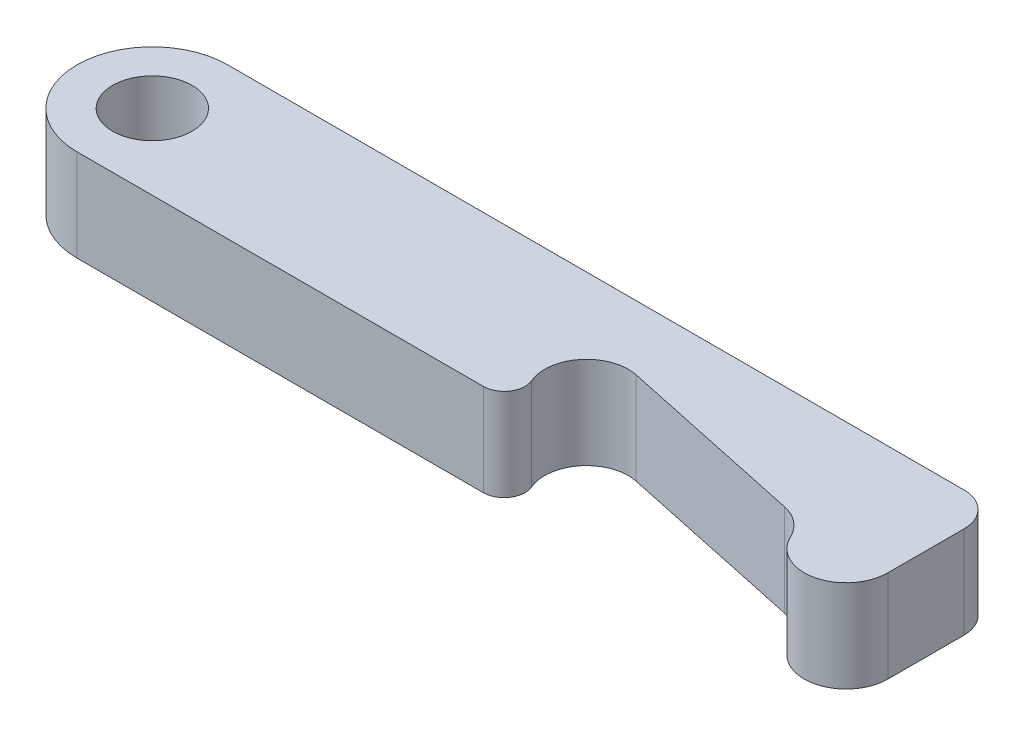
ISO-10303-21;
HEADER;
FILE_DESCRIPTION(('STEP AP214'),'2;1');
FILE_NAME('part.step','',(''),(''),'','','');
FILE_SCHEMA(('AUTOMOTIVE_DESIGN { 1 0 10303 214 1 1 1 1 }'));
ENDSEC;
DATA;
#1=APPLICATION_CONTEXT('core data for automotive mechanical design processes');
#2=APPLICATION_PROTOCOL_DEFINITION('international standard','automotive_design',2000,#1);
#3=PRODUCT_CONTEXT('',#1,'mechanical');
#4=PRODUCT('Part','Part','',(#3));
#5=PRODUCT_RELATED_PRODUCT_CATEGORY('part','',(#4));
#6=PRODUCT_DEFINITION_FORMATION('','',#4);
#7=PRODUCT_DEFINITION_CONTEXT('part definition',#1,'design');
#8=PRODUCT_DEFINITION('design','',#6,#7);
#9=PRODUCT_DEFINITION_SHAPE('','',#8);
#10=(LENGTH_UNIT() NAMED_UNIT(*) SI_UNIT(.MILLI.,.METRE.));
#11=(NAMED_UNIT(*) PLANE_ANGLE_UNIT() SI_UNIT($,.RADIAN.));
#12=(NAMED_UNIT(*) SI_UNIT($,.STERADIAN.) SOLID_ANGLE_UNIT());
#13=UNCERTAINTY_MEASURE_WITH_UNIT(LENGTH_MEASURE(1.E-05),#10,'distance_accuracy_value','');
#14=(GEOMETRIC_REPRESENTATION_CONTEXT(3) GLOBAL_UNCERTAINTY_ASSIGNED_CONTEXT((#13)) GLOBAL_UNIT_ASSIGNED_CONTEXT((#10,
#11,#12)) REPRESENTATION_CONTEXT('',''));
#15=CARTESIAN_POINT('',(0.,0.,0.));
#16=DIRECTION('',(0.,0.,1.));
#17=DIRECTION('',(1.,0.,0.));
#18=AXIS2_PLACEMENT_3D('',#15,#16,#17);
#19=CARTESIAN_POINT('',(0.,11.,0.));
#20=DIRECTION('',(0.,-1.,0.));
#21=DIRECTION('',(0.,0.,-1.));
#22=AXIS2_PLACEMENT_3D('',#19,#20,#21);
#23=PLANE('',#22);
#24=CARTESIAN_POINT('',(0.,11.,0.));
#25=DIRECTION('',(0.,1.,0.));
#26=DIRECTION('',(0.,0.,-1.));
#27=AXIS2_PLACEMENT_3D('',#24,#25,#26);
#28=CIRCLE('',#27,9.);
#29=CARTESIAN_POINT('',(0.,11.,-9.));
#30=VERTEX_POINT('',#29);
#31=CARTESIAN_POINT('',(0.,11.,9.));
#32=VERTEX_POINT('',#31);
#33=EDGE_CURVE('E186',#30,#32,#28,.T.);
#34=ORIENTED_EDGE('',*,*,#33,.T.);
#35=DIRECTION('',(1.,0.,0.));
#36=VECTOR('',#35,1.);
#37=CARTESIAN_POINT('',(0.,11.,9.));
#38=LINE('',#37,#36);
#39=CARTESIAN_POINT('',(48.5363182695525,11.,9.));
#40=VERTEX_POINT('',#39);
#41=EDGE_CURVE('E110',#32,#40,#38,.T.);
#42=ORIENTED_EDGE('',*,*,#41,.T.);
#43=CARTESIAN_POINT('',(48.5363182695525,11.,6.5));
#44=DIRECTION('',(0.,1.,0.));
#45=DIRECTION('',(0.,0.,-1.));
#46=AXIS2_PLACEMENT_3D('',#43,#44,#45);
#47=CIRCLE('',#46,2.5);
#48=CARTESIAN_POINT('',(50.8371468394263,11.,5.52215139614962));
#49=VERTEX_POINT('',#48);
#50=EDGE_CURVE('E215',#40,#49,#47,.T.);
#51=ORIENTED_EDGE('',*,*,#50,.T.);
#52=CARTESIAN_POINT('',(55.4388039791741,11.,3.56645418844886));
#53=DIRECTION('',(0.,-1.,0.));
#54=DIRECTION('',(0.,0.,1.));
#55=AXIS2_PLACEMENT_3D('',#52,#53,#54);
#56=CIRCLE('',#55,5.);
#57=CARTESIAN_POINT('',(56.4783624332629,11.,-1.32428381522018));
#58=VERTEX_POINT('',#57);
#59=EDGE_CURVE('E235',#49,#58,#56,.T.);
#60=ORIENTED_EDGE('',*,*,#59,.T.);
#61=DIRECTION('',(0.978147600733807,0.,0.207911690817753));
#62=VECTOR('',#61,1.);
#63=CARTESIAN_POINT('',(78.9783624332629,11.,3.45823882235517));
#64=LINE('',#63,#62);
#65=CARTESIAN_POINT('',(78.9783624332629,11.,3.45823882235517));
#66=VERTEX_POINT('',#65);
#67=EDGE_CURVE('E231',#58,#66,#64,.T.);
#68=ORIENTED_EDGE('',*,*,#67,.T.);
#69=CARTESIAN_POINT('',(77.9388039791741,11.,8.3489768260242));
#70=DIRECTION('',(0.,-1.,0.));
#71=DIRECTION('',(0.,0.,1.));
#72=AXIS2_PLACEMENT_3D('',#69,#70,#71);
#73=CIRCLE('',#72,5.);
#74=CARTESIAN_POINT('',(82.4694019895871,11.,6.23386886943139));
#75=VERTEX_POINT('',#74);
#76=EDGE_CURVE('E234',#66,#75,#73,.T.);
#77=ORIENTED_EDGE('',*,*,#76,.T.);
#78=CARTESIAN_POINT('',(87.,11.,4.11876091283859));
#79=DIRECTION('',(0.,1.,0.));
#80=DIRECTION('',(0.,0.,-1.));
#81=AXIS2_PLACEMENT_3D('',#78,#79,#80);
#82=CIRCLE('',#81,5.00000000000001);
#83=CARTESIAN_POINT('',(92.,11.,4.11876091283859));
#84=VERTEX_POINT('',#83);
#85=EDGE_CURVE('E135',#75,#84,#82,.T.);
#86=ORIENTED_EDGE('',*,*,#85,.T.);
#87=DIRECTION('',(0.,0.,-1.));
#88=VECTOR('',#87,1.);
#89=CARTESIAN_POINT('',(92.,11.,-5.));
#90=LINE('',#89,#88);
#91=CARTESIAN_POINT('',(92.,11.,-5.));
#92=VERTEX_POINT('',#91);
#93=EDGE_CURVE('E129',#84,#92,#90,.T.);
#94=ORIENTED_EDGE('',*,*,#93,.T.);
#95=CARTESIAN_POINT('',(88.,11.,-5.));
#96=DIRECTION('',(0.,1.,0.));
#97=DIRECTION('',(0.,0.,-1.));
#98=AXIS2_PLACEMENT_3D('',#95,#96,#97);
#99=CIRCLE('',#98,4.);
#100=CARTESIAN_POINT('',(88.,11.,-9.));
#101=VERTEX_POINT('',#100);
#102=EDGE_CURVE('E133',#92,#101,#99,.T.);
#103=ORIENTED_EDGE('',*,*,#102,.T.);
#104=DIRECTION('',(-1.,0.,0.));
#105=VECTOR('',#104,1.);
#106=CARTESIAN_POINT('',(0.,11.,-9.));
#107=LINE('',#106,#105);
#108=EDGE_CURVE('E61',#101,#30,#107,.T.);
#109=ORIENTED_EDGE('',*,*,#108,.T.);
#110=EDGE_LOOP('',(#34,#42,#51,#60,#68,#77,#86,#94,#103,#109));
#111=FACE_BOUND('',#110,.T.);
#112=CARTESIAN_POINT('',(0.,11.,0.));
#113=DIRECTION('',(0.,1.,0.));
#114=DIRECTION('',(0.,0.,1.));
#115=AXIS2_PLACEMENT_3D('',#112,#113,#114);
#116=CIRCLE('',#115,4.75);
#117=CARTESIAN_POINT('',(0.,11.,4.75));
#118=VERTEX_POINT('',#117);
#119=EDGE_CURVE('E162',#118,#118,#116,.T.);
#120=ORIENTED_EDGE('',*,*,#119,.F.);
#121=EDGE_LOOP('',(#120));
#122=FACE_BOUND('',#121,.T.);
#123=ADVANCED_FACE('F43',(#111,#122),#23,.F.);
#124=CARTESIAN_POINT('',(0.,0.,0.));
#125=DIRECTION('',(0.,-1.,0.));
#126=DIRECTION('',(0.,0.,-1.));
#127=AXIS2_PLACEMENT_3D('',#124,#125,#126);
#128=PLANE('',#127);
#129=CARTESIAN_POINT('',(0.,0.,0.));
#130=DIRECTION('',(0.,1.,0.));
#131=DIRECTION('',(0.,0.,-1.));
#132=AXIS2_PLACEMENT_3D('',#129,#130,#131);
#133=CIRCLE('',#132,9.);
#134=CARTESIAN_POINT('',(0.,0.,-9.));
#135=VERTEX_POINT('',#134);
#136=CARTESIAN_POINT('',(0.,0.,9.));
#137=VERTEX_POINT('',#136);
#138=EDGE_CURVE('E157',#135,#137,#133,.T.);
#139=ORIENTED_EDGE('',*,*,#138,.F.);
#140=DIRECTION('',(-1.,0.,0.));
#141=VECTOR('',#140,1.);
#142=CARTESIAN_POINT('',(0.,0.,-9.));
#143=LINE('',#142,#141);
#144=CARTESIAN_POINT('',(88.,0.,-9.));
#145=VERTEX_POINT('',#144);
#146=EDGE_CURVE('E102',#145,#135,#143,.T.);
#147=ORIENTED_EDGE('',*,*,#146,.F.);
#148=CARTESIAN_POINT('',(88.,0.,-5.));
#149=DIRECTION('',(0.,1.,0.));
#150=DIRECTION('',(0.,0.,-1.));
#151=AXIS2_PLACEMENT_3D('',#148,#149,#150);
#152=CIRCLE('',#151,4.);
#153=CARTESIAN_POINT('',(92.,0.,-5.));
#154=VERTEX_POINT('',#153);
#155=EDGE_CURVE('E96',#154,#145,#152,.T.);
#156=ORIENTED_EDGE('',*,*,#155,.F.);
#157=DIRECTION('',(0.,0.,-1.));
#158=VECTOR('',#157,1.);
#159=CARTESIAN_POINT('',(92.,0.,-5.));
#160=LINE('',#159,#158);
#161=CARTESIAN_POINT('',(92.,0.,4.11876091283859));
#162=VERTEX_POINT('',#161);
#163=EDGE_CURVE('E144',#162,#154,#160,.T.);
#164=ORIENTED_EDGE('',*,*,#163,.F.);
#165=CARTESIAN_POINT('',(87.,0.,4.11876091283859));
#166=DIRECTION('',(0.,1.,0.));
#167=DIRECTION('',(0.,0.,-1.));
#168=AXIS2_PLACEMENT_3D('',#165,#166,#167);
#169=CIRCLE('',#168,5.00000000000001);
#170=CARTESIAN_POINT('',(82.4694019895871,0.,6.23386886943139));
#171=VERTEX_POINT('',#170);
#172=EDGE_CURVE('E177',#171,#162,#169,.T.);
#173=ORIENTED_EDGE('',*,*,#172,.F.);
#174=CARTESIAN_POINT('',(77.9388039791741,0.,8.3489768260242));
#175=DIRECTION('',(0.,-1.,0.));
#176=DIRECTION('',(0.,0.,1.));
#177=AXIS2_PLACEMENT_3D('',#174,#175,#176);
#178=CIRCLE('',#177,5.);
#179=CARTESIAN_POINT('',(78.9783624332629,0.,3.45823882235517));
#180=VERTEX_POINT('',#179);
#181=EDGE_CURVE('E174',#180,#171,#178,.T.);
#182=ORIENTED_EDGE('',*,*,#181,.F.);
#183=DIRECTION('',(0.978147600733807,0.,0.207911690817753));
#184=VECTOR('',#183,1.);
#185=CARTESIAN_POINT('',(78.9783624332629,0.,3.45823882235517));
#186=LINE('',#185,#184);
#187=CARTESIAN_POINT('',(56.4783624332629,0.,-1.32428381522018));
#188=VERTEX_POINT('',#187);
#189=EDGE_CURVE('E171',#188,#180,#186,.T.);
#190=ORIENTED_EDGE('',*,*,#189,.F.);
#191=CARTESIAN_POINT('',(55.4388039791741,0.,3.56645418844886));
#192=DIRECTION('',(0.,-1.,0.));
#193=DIRECTION('',(0.,0.,1.));
#194=AXIS2_PLACEMENT_3D('',#191,#192,#193);
#195=CIRCLE('',#194,5.);
#196=CARTESIAN_POINT('',(50.8371468394263,0.,5.52215139614962));
#197=VERTEX_POINT('',#196);
#198=EDGE_CURVE('E168',#197,#188,#195,.T.);
#199=ORIENTED_EDGE('',*,*,#198,.F.);
#200=CARTESIAN_POINT('',(48.5363182695525,0.,6.5));
#201=DIRECTION('',(0.,1.,0.));
#202=DIRECTION('',(0.,0.,-1.));
#203=AXIS2_PLACEMENT_3D('',#200,#201,#202);
#204=CIRCLE('',#203,2.5);
#205=CARTESIAN_POINT('',(48.5363182695525,0.,9.));
#206=VERTEX_POINT('',#205);
#207=EDGE_CURVE('E165',#206,#197,#204,.T.);
#208=ORIENTED_EDGE('',*,*,#207,.F.);
#209=DIRECTION('',(1.,0.,0.));
#210=VECTOR('',#209,1.);
#211=CARTESIAN_POINT('',(0.,0.,9.));
#212=LINE('',#211,#210);
#213=EDGE_CURVE('E161',#137,#206,#212,.T.);
#214=ORIENTED_EDGE('',*,*,#213,.F.);
#215=EDGE_LOOP('',(#139,#147,#156,#164,#173,#182,#190,#199,#208,#214));
#216=FACE_BOUND('',#215,.T.);
#217=CARTESIAN_POINT('',(0.,0.,0.));
#218=DIRECTION('',(0.,1.,0.));
#219=DIRECTION('',(0.,0.,1.));
#220=AXIS2_PLACEMENT_3D('',#217,#218,#219);
#221=CIRCLE('',#220,4.75);
#222=CARTESIAN_POINT('',(0.,0.,4.75));
#223=VERTEX_POINT('',#222);
#224=EDGE_CURVE('E249',#223,#223,#221,.T.);
#225=ORIENTED_EDGE('',*,*,#224,.T.);
#226=EDGE_LOOP('',(#225));
#227=FACE_BOUND('',#226,.T.);
#228=ADVANCED_FACE('F219',(#216,#227),#128,.T.);
#229=CARTESIAN_POINT('',(0.,11.,0.));
#230=DIRECTION('',(0.,-1.,0.));
#231=DIRECTION('',(0.,0.,-1.));
#232=AXIS2_PLACEMENT_3D('',#229,#230,#231);
#233=CYLINDRICAL_SURFACE('',#232,9.);
#234=ORIENTED_EDGE('',*,*,#138,.T.);
#235=DIRECTION('',(0.,-1.,0.));
#236=VECTOR('',#235,1.);
#237=CARTESIAN_POINT('',(0.,11.,9.));
#238=LINE('',#237,#236);
#239=EDGE_CURVE('E11',#32,#137,#238,.T.);
#240=ORIENTED_EDGE('',*,*,#239,.F.);
#241=ORIENTED_EDGE('',*,*,#33,.F.);
#242=DIRECTION('',(0.,-1.,0.));
#243=VECTOR('',#242,1.);
#244=CARTESIAN_POINT('',(0.,11.,-9.));
#245=LINE('',#244,#243);
#246=EDGE_CURVE('E153',#30,#135,#245,.T.);
#247=ORIENTED_EDGE('',*,*,#246,.T.);
#248=EDGE_LOOP('',(#234,#240,#241,#247));
#249=FACE_BOUND('',#248,.T.);
#250=ADVANCED_FACE('F45',(#249),#233,.T.);
#251=CARTESIAN_POINT('',(0.,11.,9.));
#252=DIRECTION('',(0.,0.,-1.));
#253=DIRECTION('',(-1.,0.,0.));
#254=AXIS2_PLACEMENT_3D('',#251,#252,#253);
#255=PLANE('',#254);
#256=ORIENTED_EDGE('',*,*,#213,.T.);
#257=DIRECTION('',(0.,-1.,0.));
#258=VECTOR('',#257,1.);
#259=CARTESIAN_POINT('',(48.5363182695525,11.,9.));
#260=LINE('',#259,#258);
#261=EDGE_CURVE('E53',#40,#206,#260,.T.);
#262=ORIENTED_EDGE('',*,*,#261,.F.);
#263=ORIENTED_EDGE('',*,*,#41,.F.);
#264=ORIENTED_EDGE('',*,*,#239,.T.);
#265=EDGE_LOOP('',(#256,#262,#263,#264));
#266=FACE_BOUND('',#265,.T.);
#267=ADVANCED_FACE('F287',(#266),#255,.F.);
#268=CARTESIAN_POINT('',(48.5363182695525,11.,6.5));
#269=DIRECTION('',(0.,-1.,0.));
#270=DIRECTION('',(0.,0.,-1.));
#271=AXIS2_PLACEMENT_3D('',#268,#269,#270);
#272=CYLINDRICAL_SURFACE('',#271,2.5);
#273=ORIENTED_EDGE('',*,*,#207,.T.);
#274=DIRECTION('',(0.,-1.,0.));
#275=VECTOR('',#274,1.);
#276=CARTESIAN_POINT('',(50.8371468394263,11.,5.52215139614962));
#277=LINE('',#276,#275);
#278=EDGE_CURVE('E205',#49,#197,#277,.T.);
#279=ORIENTED_EDGE('',*,*,#278,.F.);
#280=ORIENTED_EDGE('',*,*,#50,.F.);
#281=ORIENTED_EDGE('',*,*,#261,.T.);
#282=EDGE_LOOP('',(#273,#279,#280,#281));
#283=FACE_BOUND('',#282,.T.);
#284=ADVANCED_FACE('F213',(#283),#272,.T.);
#285=CARTESIAN_POINT('',(55.4388039791741,11.,3.56645418844886));
#286=DIRECTION('',(0.,-1.,0.));
#287=DIRECTION('',(0.,0.,-1.));
#288=AXIS2_PLACEMENT_3D('',#285,#286,#287);
#289=CYLINDRICAL_SURFACE('',#288,5.);
#290=ORIENTED_EDGE('',*,*,#198,.T.);
#291=DIRECTION('',(0.,-1.,0.));
#292=VECTOR('',#291,1.);
#293=CARTESIAN_POINT('',(56.4783624332629,11.,-1.32428381522018));
#294=LINE('',#293,#292);
#295=EDGE_CURVE('E201',#58,#188,#294,.T.);
#296=ORIENTED_EDGE('',*,*,#295,.F.);
#297=ORIENTED_EDGE('',*,*,#59,.F.);
#298=ORIENTED_EDGE('',*,*,#278,.T.);
#299=EDGE_LOOP('',(#290,#296,#297,#298));
#300=FACE_BOUND('',#299,.T.);
#301=ADVANCED_FACE('F225',(#300),#289,.F.);
#302=CARTESIAN_POINT('',(78.9783624332629,11.,3.45823882235517));
#303=DIRECTION('',(0.207911690817753,0.,-0.978147600733807));
#304=DIRECTION('',(-0.978147600733807,0.,-0.207911690817753));
#305=AXIS2_PLACEMENT_3D('',#302,#303,#304);
#306=PLANE('',#305);
#307=ORIENTED_EDGE('',*,*,#189,.T.);
#308=DIRECTION('',(0.,-1.,0.));
#309=VECTOR('',#308,1.);
#310=CARTESIAN_POINT('',(78.9783624332629,11.,3.45823882235517));
#311=LINE('',#310,#309);
#312=EDGE_CURVE('E197',#66,#180,#311,.T.);
#313=ORIENTED_EDGE('',*,*,#312,.F.);
#314=ORIENTED_EDGE('',*,*,#67,.F.);
#315=ORIENTED_EDGE('',*,*,#295,.T.);
#316=EDGE_LOOP('',(#307,#313,#314,#315));
#317=FACE_BOUND('',#316,.T.);
#318=ADVANCED_FACE('F229',(#317),#306,.F.);
#319=CARTESIAN_POINT('',(77.9388039791741,11.,8.3489768260242));
#320=DIRECTION('',(0.,-1.,0.));
#321=DIRECTION('',(0.,0.,-1.));
#322=AXIS2_PLACEMENT_3D('',#319,#320,#321);
#323=CYLINDRICAL_SURFACE('',#322,5.);
#324=ORIENTED_EDGE('',*,*,#181,.T.);
#325=DIRECTION('',(0.,-1.,0.));
#326=VECTOR('',#325,1.);
#327=CARTESIAN_POINT('',(82.4694019895871,11.,6.23386886943139));
#328=LINE('',#327,#326);
#329=EDGE_CURVE('E193',#75,#171,#328,.T.);
#330=ORIENTED_EDGE('',*,*,#329,.F.);
#331=ORIENTED_EDGE('',*,*,#76,.F.);
#332=ORIENTED_EDGE('',*,*,#312,.T.);
#333=EDGE_LOOP('',(#324,#330,#331,#332));
#334=FACE_BOUND('',#333,.T.);
#335=ADVANCED_FACE('F277',(#334),#323,.F.);
#336=CARTESIAN_POINT('',(87.,11.,4.11876091283859));
#337=DIRECTION('',(0.,-1.,0.));
#338=DIRECTION('',(0.,0.,-1.));
#339=AXIS2_PLACEMENT_3D('',#336,#337,#338);
#340=CYLINDRICAL_SURFACE('',#339,5.00000000000001);
#341=ORIENTED_EDGE('',*,*,#172,.T.);
#342=DIRECTION('',(0.,-1.,0.));
#343=VECTOR('',#342,1.);
#344=CARTESIAN_POINT('',(92.,11.,4.11876091283859));
#345=LINE('',#344,#343);
#346=EDGE_CURVE('E146',#84,#162,#345,.T.);
#347=ORIENTED_EDGE('',*,*,#346,.F.);
#348=ORIENTED_EDGE('',*,*,#85,.F.);
#349=ORIENTED_EDGE('',*,*,#329,.T.);
#350=EDGE_LOOP('',(#341,#347,#348,#349));
#351=FACE_BOUND('',#350,.T.);
#352=ADVANCED_FACE('F274',(#351),#340,.T.);
#353=CARTESIAN_POINT('',(92.,11.,-5.));
#354=DIRECTION('',(-1.,0.,0.));
#355=DIRECTION('',(0.,0.,1.));
#356=AXIS2_PLACEMENT_3D('',#353,#354,#355);
#357=PLANE('',#356);
#358=ORIENTED_EDGE('',*,*,#163,.T.);
#359=DIRECTION('',(0.,-1.,0.));
#360=VECTOR('',#359,1.);
#361=CARTESIAN_POINT('',(92.,11.,-5.));
#362=LINE('',#361,#360);
#363=EDGE_CURVE('E141',#92,#154,#362,.T.);
#364=ORIENTED_EDGE('',*,*,#363,.F.);
#365=ORIENTED_EDGE('',*,*,#93,.F.);
#366=ORIENTED_EDGE('',*,*,#346,.T.);
#367=EDGE_LOOP('',(#358,#364,#365,#366));
#368=FACE_BOUND('',#367,.T.);
#369=ADVANCED_FACE('F142',(#368),#357,.F.);
#370=CARTESIAN_POINT('',(88.,11.,-5.));
#371=DIRECTION('',(0.,-1.,0.));
#372=DIRECTION('',(0.,0.,-1.));
#373=AXIS2_PLACEMENT_3D('',#370,#371,#372);
#374=CYLINDRICAL_SURFACE('',#373,4.);
#375=ORIENTED_EDGE('',*,*,#155,.T.);
#376=DIRECTION('',(0.,-1.,0.));
#377=VECTOR('',#376,1.);
#378=CARTESIAN_POINT('',(88.,11.,-9.));
#379=LINE('',#378,#377);
#380=EDGE_CURVE('E147',#101,#145,#379,.T.);
#381=ORIENTED_EDGE('',*,*,#380,.F.);
#382=ORIENTED_EDGE('',*,*,#102,.F.);
#383=ORIENTED_EDGE('',*,*,#363,.T.);
#384=EDGE_LOOP('',(#375,#381,#382,#383));
#385=FACE_BOUND('',#384,.T.);
#386=ADVANCED_FACE('F149',(#385),#374,.T.);
#387=CARTESIAN_POINT('',(0.,11.,-9.));
#388=DIRECTION('',(0.,0.,1.));
#389=DIRECTION('',(1.,0.,0.));
#390=AXIS2_PLACEMENT_3D('',#387,#388,#389);
#391=PLANE('',#390);
#392=ORIENTED_EDGE('',*,*,#146,.T.);
#393=ORIENTED_EDGE('',*,*,#246,.F.);
#394=ORIENTED_EDGE('',*,*,#108,.F.);
#395=ORIENTED_EDGE('',*,*,#380,.T.);
#396=EDGE_LOOP('',(#392,#393,#394,#395));
#397=FACE_BOUND('',#396,.T.);
#398=ADVANCED_FACE('F267',(#397),#391,.F.);
#399=CARTESIAN_POINT('',(0.,11.,0.));
#400=DIRECTION('',(0.,-1.,0.));
#401=DIRECTION('',(0.,0.,-1.));
#402=AXIS2_PLACEMENT_3D('',#399,#400,#401);
#403=CYLINDRICAL_SURFACE('',#402,4.75);
#404=ORIENTED_EDGE('',*,*,#119,.T.);
#405=EDGE_LOOP('',(#404));
#406=FACE_BOUND('',#405,.T.);
#407=ORIENTED_EDGE('',*,*,#224,.F.);
#408=EDGE_LOOP('',(#407));
#409=FACE_BOUND('',#408,.T.);
#410=ADVANCED_FACE('F257',(#406,#409),#403,.F.);
#411=CLOSED_SHELL('',(#123,#228,#250,#267,#284,#301,#318,#335,#352,#369,#386,#398,#410));
#412=MANIFOLD_SOLID_BREP('B2',#411);
#413=ADVANCED_BREP_SHAPE_REPRESENTATION('',(#18,#412),#14);
#414=SHAPE_DEFINITION_REPRESENTATION(#9,#413);
ENDSEC;
END-ISO-10303-21;
